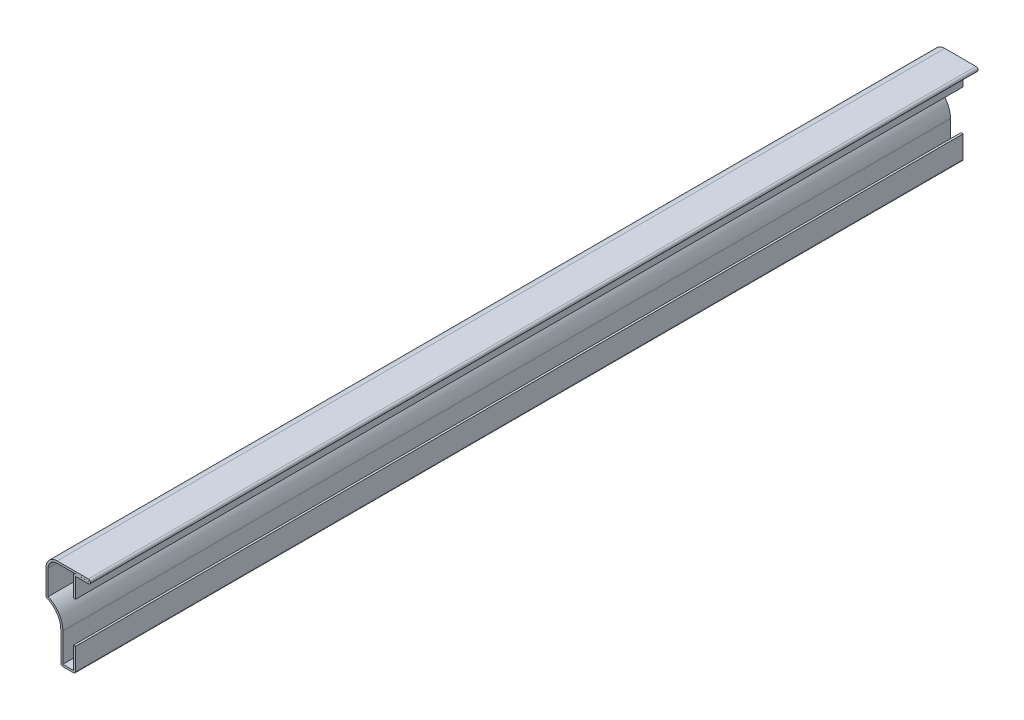
ISO-10303-21;
HEADER;
FILE_DESCRIPTION(('STEP AP214'),'2;1');
FILE_NAME('part.step','',(''),(''),'','','');
FILE_SCHEMA(('AUTOMOTIVE_DESIGN { 1 0 10303 214 1 1 1 1 }'));
ENDSEC;
DATA;
#1=APPLICATION_CONTEXT('core data for automotive mechanical design processes');
#2=APPLICATION_PROTOCOL_DEFINITION('international standard','automotive_design',2000,#1);
#3=PRODUCT_CONTEXT('',#1,'mechanical');
#4=PRODUCT('Part','Part','',(#3));
#5=PRODUCT_RELATED_PRODUCT_CATEGORY('part','',(#4));
#6=PRODUCT_DEFINITION_FORMATION('','',#4);
#7=PRODUCT_DEFINITION_CONTEXT('part definition',#1,'design');
#8=PRODUCT_DEFINITION('design','',#6,#7);
#9=PRODUCT_DEFINITION_SHAPE('','',#8);
#10=(LENGTH_UNIT() NAMED_UNIT(*) SI_UNIT(.MILLI.,.METRE.));
#11=(NAMED_UNIT(*) PLANE_ANGLE_UNIT() SI_UNIT($,.RADIAN.));
#12=(NAMED_UNIT(*) SI_UNIT($,.STERADIAN.) SOLID_ANGLE_UNIT());
#13=UNCERTAINTY_MEASURE_WITH_UNIT(LENGTH_MEASURE(1.E-05),#10,'distance_accuracy_value','');
#14=(GEOMETRIC_REPRESENTATION_CONTEXT(3) GLOBAL_UNCERTAINTY_ASSIGNED_CONTEXT((#13)) GLOBAL_UNIT_ASSIGNED_CONTEXT((#10,
#11,#12)) REPRESENTATION_CONTEXT('',''));
#15=CARTESIAN_POINT('',(0.,0.,0.));
#16=DIRECTION('',(0.,0.,1.));
#17=DIRECTION('',(1.,0.,0.));
#18=AXIS2_PLACEMENT_3D('',#15,#16,#17);
#19=CARTESIAN_POINT('',(0.,0.,-381.));
#20=DIRECTION('',(1.,0.,0.));
#21=DIRECTION('',(0.,0.,-1.));
#22=AXIS2_PLACEMENT_3D('',#19,#20,#21);
#23=PLANE('',#22);
#24=DIRECTION('',(0.,1.,0.));
#25=VECTOR('',#24,1.);
#26=CARTESIAN_POINT('',(0.,0.,0.));
#27=LINE('',#26,#25);
#28=CARTESIAN_POINT('',(0.,0.889,0.));
#29=VERTEX_POINT('',#28);
#30=CARTESIAN_POINT('',(0.,10.31875,0.));
#31=VERTEX_POINT('',#30);
#32=EDGE_CURVE('E352',#29,#31,#27,.T.);
#33=ORIENTED_EDGE('',*,*,#32,.F.);
#34=DIRECTION('',(0.,0.,1.));
#35=VECTOR('',#34,1.);
#36=CARTESIAN_POINT('',(0.,0.889,-381.));
#37=LINE('',#36,#35);
#38=CARTESIAN_POINT('',(0.,0.889,-381.));
#39=VERTEX_POINT('',#38);
#40=EDGE_CURVE('E216',#29,#39,#37,.F.);
#41=ORIENTED_EDGE('',*,*,#40,.T.);
#42=DIRECTION('',(0.,1.,0.));
#43=VECTOR('',#42,1.);
#44=CARTESIAN_POINT('',(0.,0.,-381.));
#45=LINE('',#44,#43);
#46=CARTESIAN_POINT('',(0.,10.31875,-381.));
#47=VERTEX_POINT('',#46);
#48=EDGE_CURVE('E209',#39,#47,#45,.T.);
#49=ORIENTED_EDGE('',*,*,#48,.T.);
#50=DIRECTION('',(0.,0.,1.));
#51=VECTOR('',#50,1.);
#52=CARTESIAN_POINT('',(0.,10.31875,-381.));
#53=LINE('',#52,#51);
#54=EDGE_CURVE('E213',#47,#31,#53,.T.);
#55=ORIENTED_EDGE('',*,*,#54,.T.);
#56=EDGE_LOOP('',(#33,#41,#49,#55));
#57=FACE_BOUND('',#56,.T.);
#58=ADVANCED_FACE('F35',(#57),#23,.T.);
#59=CARTESIAN_POINT('',(-6.35,0.,-381.));
#60=DIRECTION('',(0.,-1.,0.));
#61=DIRECTION('',(0.,0.,-1.));
#62=AXIS2_PLACEMENT_3D('',#59,#60,#61);
#63=PLANE('',#62);
#64=DIRECTION('',(1.,0.,0.));
#65=VECTOR('',#64,1.);
#66=CARTESIAN_POINT('',(-6.35,0.,-381.));
#67=LINE('',#66,#65);
#68=CARTESIAN_POINT('',(-5.461,0.,-381.));
#69=VERTEX_POINT('',#68);
#70=CARTESIAN_POINT('',(-0.889,0.,-381.));
#71=VERTEX_POINT('',#70);
#72=EDGE_CURVE('E233',#69,#71,#67,.T.);
#73=ORIENTED_EDGE('',*,*,#72,.T.);
#74=DIRECTION('',(0.,0.,1.));
#75=VECTOR('',#74,1.);
#76=CARTESIAN_POINT('',(-0.889,0.,-381.));
#77=LINE('',#76,#75);
#78=CARTESIAN_POINT('',(-0.889,0.,0.));
#79=VERTEX_POINT('',#78);
#80=EDGE_CURVE('E244',#71,#79,#77,.T.);
#81=ORIENTED_EDGE('',*,*,#80,.T.);
#82=DIRECTION('',(1.,0.,0.));
#83=VECTOR('',#82,1.);
#84=CARTESIAN_POINT('',(-6.35,0.,0.));
#85=LINE('',#84,#83);
#86=CARTESIAN_POINT('',(-5.461,0.,0.));
#87=VERTEX_POINT('',#86);
#88=EDGE_CURVE('E219',#87,#79,#85,.T.);
#89=ORIENTED_EDGE('',*,*,#88,.F.);
#90=DIRECTION('',(0.,0.,1.));
#91=VECTOR('',#90,1.);
#92=CARTESIAN_POINT('',(-5.461,0.,-381.));
#93=LINE('',#92,#91);
#94=EDGE_CURVE('E242',#87,#69,#93,.F.);
#95=ORIENTED_EDGE('',*,*,#94,.T.);
#96=EDGE_LOOP('',(#73,#81,#89,#95));
#97=FACE_BOUND('',#96,.T.);
#98=ADVANCED_FACE('F407',(#97),#63,.T.);
#99=CARTESIAN_POINT('',(-6.34999999999999,13.2447438789308,-381.));
#100=DIRECTION('',(-1.,0.,0.));
#101=DIRECTION('',(0.,-1.,0.));
#102=AXIS2_PLACEMENT_3D('',#99,#100,#101);
#103=PLANE('',#102);
#104=DIRECTION('',(0.,-1.,0.));
#105=VECTOR('',#104,1.);
#106=CARTESIAN_POINT('',(-6.34999999999999,13.2447438789308,-381.));
#107=LINE('',#106,#105);
#108=CARTESIAN_POINT('',(-6.34999999999999,13.2447438789308,-381.));
#109=VERTEX_POINT('',#108);
#110=CARTESIAN_POINT('',(-6.35,0.889000000000001,-381.));
#111=VERTEX_POINT('',#110);
#112=EDGE_CURVE('E238',#109,#111,#107,.T.);
#113=ORIENTED_EDGE('',*,*,#112,.T.);
#114=DIRECTION('',(0.,0.,1.));
#115=VECTOR('',#114,1.);
#116=CARTESIAN_POINT('',(-6.35,0.889000000000001,-381.));
#117=LINE('',#116,#115);
#118=CARTESIAN_POINT('',(-6.35,0.889000000000001,0.));
#119=VERTEX_POINT('',#118);
#120=EDGE_CURVE('E264',#111,#119,#117,.T.);
#121=ORIENTED_EDGE('',*,*,#120,.T.);
#122=DIRECTION('',(0.,-1.,0.));
#123=VECTOR('',#122,1.);
#124=CARTESIAN_POINT('',(-6.34999999999999,13.2447438789308,0.));
#125=LINE('',#124,#123);
#126=CARTESIAN_POINT('',(-6.34999999999999,13.2447438789308,0.));
#127=VERTEX_POINT('',#126);
#128=EDGE_CURVE('E292',#127,#119,#125,.T.);
#129=ORIENTED_EDGE('',*,*,#128,.F.);
#130=DIRECTION('',(0.,0.,1.));
#131=VECTOR('',#130,1.);
#132=CARTESIAN_POINT('',(-6.34999999999999,13.2447438789308,-381.));
#133=LINE('',#132,#131);
#134=EDGE_CURVE('E245',#109,#127,#133,.T.);
#135=ORIENTED_EDGE('',*,*,#134,.F.);
#136=EDGE_LOOP('',(#113,#121,#129,#135));
#137=FACE_BOUND('',#136,.T.);
#138=ADVANCED_FACE('F416',(#137),#103,.T.);
#139=CARTESIAN_POINT('',(-15.875,13.2447438789308,-381.));
#140=DIRECTION('',(0.,0.,1.));
#141=DIRECTION('',(1.,0.,0.));
#142=AXIS2_PLACEMENT_3D('',#139,#140,#141);
#143=CYLINDRICAL_SURFACE('',#142,9.525);
#144=CARTESIAN_POINT('',(-15.875,13.2447438789308,0.));
#145=DIRECTION('',(0.,0.,-1.));
#146=DIRECTION('',(-1.,0.,0.));
#147=AXIS2_PLACEMENT_3D('',#144,#145,#146);
#148=CIRCLE('',#147,9.525);
#149=CARTESIAN_POINT('',(-12.1579268292683,22.0145210735594,0.));
#150=VERTEX_POINT('',#149);
#151=EDGE_CURVE('E290',#150,#127,#148,.T.);
#152=ORIENTED_EDGE('',*,*,#151,.F.);
#153=DIRECTION('',(0.,0.,1.));
#154=VECTOR('',#153,1.);
#155=CARTESIAN_POINT('',(-12.1579268292683,22.0145210735594,-381.));
#156=LINE('',#155,#154);
#157=CARTESIAN_POINT('',(-12.1579268292683,22.0145210735594,-381.));
#158=VERTEX_POINT('',#157);
#159=EDGE_CURVE('E11',#150,#158,#156,.F.);
#160=ORIENTED_EDGE('',*,*,#159,.T.);
#161=CARTESIAN_POINT('',(-15.875,13.2447438789308,-381.));
#162=DIRECTION('',(0.,0.,-1.));
#163=DIRECTION('',(-1.,0.,0.));
#164=AXIS2_PLACEMENT_3D('',#161,#162,#163);
#165=CIRCLE('',#164,9.525);
#166=EDGE_CURVE('E394',#158,#109,#165,.T.);
#167=ORIENTED_EDGE('',*,*,#166,.T.);
#168=ORIENTED_EDGE('',*,*,#134,.T.);
#169=EDGE_LOOP('',(#152,#160,#167,#168));
#170=FACE_BOUND('',#169,.T.);
#171=ADVANCED_FACE('F419',(#170),#143,.F.);
#172=CARTESIAN_POINT('',(-12.7,33.3375,-381.));
#173=DIRECTION('',(-1.,0.,0.));
#174=DIRECTION('',(0.,-1.,0.));
#175=AXIS2_PLACEMENT_3D('',#172,#173,#174);
#176=PLANE('',#175);
#177=DIRECTION('',(0.,-1.,0.));
#178=VECTOR('',#177,1.);
#179=CARTESIAN_POINT('',(-12.7,33.3375,-381.));
#180=LINE('',#179,#178);
#181=CARTESIAN_POINT('',(-12.7,33.3375,-381.));
#182=VERTEX_POINT('',#181);
#183=CARTESIAN_POINT('',(-12.7,22.8330336117247,-381.));
#184=VERTEX_POINT('',#183);
#185=EDGE_CURVE('E280',#182,#184,#180,.T.);
#186=ORIENTED_EDGE('',*,*,#185,.T.);
#187=DIRECTION('',(0.,0.,1.));
#188=VECTOR('',#187,1.);
#189=CARTESIAN_POINT('',(-12.7,22.8330336117247,-381.));
#190=LINE('',#189,#188);
#191=CARTESIAN_POINT('',(-12.7,22.8330336117247,0.));
#192=VERTEX_POINT('',#191);
#193=EDGE_CURVE('E43',#184,#192,#190,.T.);
#194=ORIENTED_EDGE('',*,*,#193,.T.);
#195=DIRECTION('',(0.,-1.,0.));
#196=VECTOR('',#195,1.);
#197=CARTESIAN_POINT('',(-12.7,33.3375,0.));
#198=LINE('',#197,#196);
#199=CARTESIAN_POINT('',(-12.7,33.3375,0.));
#200=VERTEX_POINT('',#199);
#201=EDGE_CURVE('E277',#200,#192,#198,.T.);
#202=ORIENTED_EDGE('',*,*,#201,.F.);
#203=DIRECTION('',(0.,0.,1.));
#204=VECTOR('',#203,1.);
#205=CARTESIAN_POINT('',(-12.7,33.3375,-381.));
#206=LINE('',#205,#204);
#207=EDGE_CURVE('E303',#182,#200,#206,.T.);
#208=ORIENTED_EDGE('',*,*,#207,.F.);
#209=EDGE_LOOP('',(#186,#194,#202,#208));
#210=FACE_BOUND('',#209,.T.);
#211=ADVANCED_FACE('F276',(#210),#176,.T.);
#212=CARTESIAN_POINT('',(-7.9375,33.3375,-381.));
#213=DIRECTION('',(0.,0.,1.));
#214=DIRECTION('',(1.,0.,0.));
#215=AXIS2_PLACEMENT_3D('',#212,#213,#214);
#216=CYLINDRICAL_SURFACE('',#215,4.7625);
#217=CARTESIAN_POINT('',(-7.9375,33.3375,0.));
#218=DIRECTION('',(0.,0.,1.));
#219=DIRECTION('',(1.,0.,0.));
#220=AXIS2_PLACEMENT_3D('',#217,#218,#219);
#221=CIRCLE('',#220,4.7625);
#222=CARTESIAN_POINT('',(-7.9375,38.1,0.));
#223=VERTEX_POINT('',#222);
#224=EDGE_CURVE('E289',#223,#200,#221,.T.);
#225=ORIENTED_EDGE('',*,*,#224,.F.);
#226=DIRECTION('',(0.,0.,1.));
#227=VECTOR('',#226,1.);
#228=CARTESIAN_POINT('',(-7.9375,38.1,-381.));
#229=LINE('',#228,#227);
#230=CARTESIAN_POINT('',(-7.9375,38.1,-381.));
#231=VERTEX_POINT('',#230);
#232=EDGE_CURVE('E305',#231,#223,#229,.T.);
#233=ORIENTED_EDGE('',*,*,#232,.F.);
#234=CARTESIAN_POINT('',(-7.9375,33.3375,-381.));
#235=DIRECTION('',(0.,0.,1.));
#236=DIRECTION('',(1.,0.,0.));
#237=AXIS2_PLACEMENT_3D('',#234,#235,#236);
#238=CIRCLE('',#237,4.7625);
#239=EDGE_CURVE('E392',#231,#182,#238,.T.);
#240=ORIENTED_EDGE('',*,*,#239,.T.);
#241=ORIENTED_EDGE('',*,*,#207,.T.);
#242=EDGE_LOOP('',(#225,#233,#240,#241));
#243=FACE_BOUND('',#242,.T.);
#244=ADVANCED_FACE('F391',(#243),#216,.T.);
#245=CARTESIAN_POINT('',(5.4483,38.1,-381.));
#246=DIRECTION('',(0.,1.,0.));
#247=DIRECTION('',(0.,0.,1.));
#248=AXIS2_PLACEMENT_3D('',#245,#246,#247);
#249=PLANE('',#248);
#250=DIRECTION('',(-1.,0.,0.));
#251=VECTOR('',#250,1.);
#252=CARTESIAN_POINT('',(5.4483,38.1,0.));
#253=LINE('',#252,#251);
#254=CARTESIAN_POINT('',(5.4483,38.1,0.));
#255=VERTEX_POINT('',#254);
#256=EDGE_CURVE('E294',#255,#223,#253,.T.);
#257=ORIENTED_EDGE('',*,*,#256,.F.);
#258=DIRECTION('',(0.,0.,1.));
#259=VECTOR('',#258,1.);
#260=CARTESIAN_POINT('',(5.4483,38.1,-381.));
#261=LINE('',#260,#259);
#262=CARTESIAN_POINT('',(5.4483,38.1,-381.));
#263=VERTEX_POINT('',#262);
#264=EDGE_CURVE('E307',#263,#255,#261,.T.);
#265=ORIENTED_EDGE('',*,*,#264,.F.);
#266=DIRECTION('',(-1.,0.,0.));
#267=VECTOR('',#266,1.);
#268=CARTESIAN_POINT('',(5.4483,38.1,-381.));
#269=LINE('',#268,#267);
#270=EDGE_CURVE('E387',#263,#231,#269,.T.);
#271=ORIENTED_EDGE('',*,*,#270,.T.);
#272=ORIENTED_EDGE('',*,*,#232,.T.);
#273=EDGE_LOOP('',(#257,#265,#271,#272));
#274=FACE_BOUND('',#273,.T.);
#275=ADVANCED_FACE('F384',(#274),#249,.T.);
#276=CARTESIAN_POINT('',(5.4483,37.1983,-381.));
#277=DIRECTION('',(0.,0.,1.));
#278=DIRECTION('',(1.,0.,0.));
#279=AXIS2_PLACEMENT_3D('',#276,#277,#278);
#280=CYLINDRICAL_SURFACE('',#279,0.901699999999998);
#281=CARTESIAN_POINT('',(5.4483,37.1983,0.));
#282=DIRECTION('',(0.,0.,1.));
#283=DIRECTION('',(1.,0.,0.));
#284=AXIS2_PLACEMENT_3D('',#281,#282,#283);
#285=CIRCLE('',#284,0.901699999999998);
#286=CARTESIAN_POINT('',(5.4483,36.2966,0.));
#287=VERTEX_POINT('',#286);
#288=EDGE_CURVE('E379',#287,#255,#285,.T.);
#289=ORIENTED_EDGE('',*,*,#288,.F.);
#290=DIRECTION('',(0.,0.,1.));
#291=VECTOR('',#290,1.);
#292=CARTESIAN_POINT('',(5.4483,36.2966,-381.));
#293=LINE('',#292,#291);
#294=CARTESIAN_POINT('',(5.4483,36.2966,-381.));
#295=VERTEX_POINT('',#294);
#296=EDGE_CURVE('E309',#295,#287,#293,.T.);
#297=ORIENTED_EDGE('',*,*,#296,.F.);
#298=CARTESIAN_POINT('',(5.4483,37.1983,-381.));
#299=DIRECTION('',(0.,0.,1.));
#300=DIRECTION('',(1.,0.,0.));
#301=AXIS2_PLACEMENT_3D('',#298,#299,#300);
#302=CIRCLE('',#301,0.901699999999998);
#303=EDGE_CURVE('E681',#295,#263,#302,.T.);
#304=ORIENTED_EDGE('',*,*,#303,.T.);
#305=ORIENTED_EDGE('',*,*,#264,.T.);
#306=EDGE_LOOP('',(#289,#297,#304,#305));
#307=FACE_BOUND('',#306,.T.);
#308=ADVANCED_FACE('F593',(#307),#280,.T.);
#309=CARTESIAN_POINT('',(0.,36.2966,-381.));
#310=DIRECTION('',(0.,-1.,0.));
#311=DIRECTION('',(1.,0.,0.));
#312=AXIS2_PLACEMENT_3D('',#309,#310,#311);
#313=PLANE('',#312);
#314=DIRECTION('',(1.,0.,0.));
#315=VECTOR('',#314,1.);
#316=CARTESIAN_POINT('',(0.,36.2966,0.));
#317=LINE('',#316,#315);
#318=CARTESIAN_POINT('',(0.,36.2966,0.));
#319=VERTEX_POINT('',#318);
#320=EDGE_CURVE('E376',#319,#287,#317,.T.);
#321=ORIENTED_EDGE('',*,*,#320,.F.);
#322=DIRECTION('',(0.,0.,1.));
#323=VECTOR('',#322,1.);
#324=CARTESIAN_POINT('',(0.,36.2966,-381.));
#325=LINE('',#324,#323);
#326=CARTESIAN_POINT('',(0.,36.2966,-381.));
#327=VERTEX_POINT('',#326);
#328=EDGE_CURVE('E311',#327,#319,#325,.T.);
#329=ORIENTED_EDGE('',*,*,#328,.F.);
#330=DIRECTION('',(1.,0.,0.));
#331=VECTOR('',#330,1.);
#332=CARTESIAN_POINT('',(0.,36.2966,-381.));
#333=LINE('',#332,#331);
#334=EDGE_CURVE('E678',#327,#295,#333,.T.);
#335=ORIENTED_EDGE('',*,*,#334,.T.);
#336=ORIENTED_EDGE('',*,*,#296,.T.);
#337=EDGE_LOOP('',(#321,#329,#335,#336));
#338=FACE_BOUND('',#337,.T.);
#339=ADVANCED_FACE('F584',(#338),#313,.T.);
#340=CARTESIAN_POINT('',(0.,27.78125,-381.));
#341=DIRECTION('',(1.,0.,0.));
#342=DIRECTION('',(0.,0.,-1.));
#343=AXIS2_PLACEMENT_3D('',#340,#341,#342);
#344=PLANE('',#343);
#345=DIRECTION('',(0.,1.,0.));
#346=VECTOR('',#345,1.);
#347=CARTESIAN_POINT('',(0.,27.78125,0.));
#348=LINE('',#347,#346);
#349=CARTESIAN_POINT('',(0.,27.78125,0.));
#350=VERTEX_POINT('',#349);
#351=EDGE_CURVE('E373',#350,#319,#348,.T.);
#352=ORIENTED_EDGE('',*,*,#351,.F.);
#353=DIRECTION('',(0.,0.,1.));
#354=VECTOR('',#353,1.);
#355=CARTESIAN_POINT('',(0.,27.78125,-381.));
#356=LINE('',#355,#354);
#357=CARTESIAN_POINT('',(0.,27.78125,-381.));
#358=VERTEX_POINT('',#357);
#359=EDGE_CURVE('E313',#358,#350,#356,.T.);
#360=ORIENTED_EDGE('',*,*,#359,.F.);
#361=DIRECTION('',(0.,1.,0.));
#362=VECTOR('',#361,1.);
#363=CARTESIAN_POINT('',(0.,27.78125,-381.));
#364=LINE('',#363,#362);
#365=EDGE_CURVE('E682',#358,#327,#364,.T.);
#366=ORIENTED_EDGE('',*,*,#365,.T.);
#367=ORIENTED_EDGE('',*,*,#328,.T.);
#368=EDGE_LOOP('',(#352,#360,#366,#367));
#369=FACE_BOUND('',#368,.T.);
#370=ADVANCED_FACE('F575',(#369),#344,.T.);
#371=CARTESIAN_POINT('',(0.,27.78125,-381.));
#372=DIRECTION('',(0.,1.,0.));
#373=DIRECTION('',(0.,0.,1.));
#374=AXIS2_PLACEMENT_3D('',#371,#372,#373);
#375=PLANE('',#374);
#376=DIRECTION('',(-1.,0.,0.));
#377=VECTOR('',#376,1.);
#378=CARTESIAN_POINT('',(0.,27.78125,0.));
#379=LINE('',#378,#377);
#380=CARTESIAN_POINT('',(-0.889,27.78125,0.));
#381=VERTEX_POINT('',#380);
#382=EDGE_CURVE('E371',#350,#381,#379,.T.);
#383=ORIENTED_EDGE('',*,*,#382,.T.);
#384=DIRECTION('',(0.,0.,1.));
#385=VECTOR('',#384,1.);
#386=CARTESIAN_POINT('',(-0.889,27.78125,-381.));
#387=LINE('',#386,#385);
#388=CARTESIAN_POINT('',(-0.889,27.78125,-381.));
#389=VERTEX_POINT('',#388);
#390=EDGE_CURVE('E315',#389,#381,#387,.T.);
#391=ORIENTED_EDGE('',*,*,#390,.F.);
#392=DIRECTION('',(-1.,0.,0.));
#393=VECTOR('',#392,1.);
#394=CARTESIAN_POINT('',(0.,27.78125,-381.));
#395=LINE('',#394,#393);
#396=EDGE_CURVE('E685',#358,#389,#395,.T.);
#397=ORIENTED_EDGE('',*,*,#396,.F.);
#398=ORIENTED_EDGE('',*,*,#359,.T.);
#399=EDGE_LOOP('',(#383,#391,#397,#398));
#400=FACE_BOUND('',#399,.T.);
#401=ADVANCED_FACE('F567',(#400),#375,.F.);
#402=CARTESIAN_POINT('',(-0.889,27.78125,-381.));
#403=DIRECTION('',(1.,0.,0.));
#404=DIRECTION('',(0.,0.,-1.));
#405=AXIS2_PLACEMENT_3D('',#402,#403,#404);
#406=PLANE('',#405);
#407=DIRECTION('',(0.,1.,0.));
#408=VECTOR('',#407,1.);
#409=CARTESIAN_POINT('',(-0.889,27.78125,0.));
#410=LINE('',#409,#408);
#411=CARTESIAN_POINT('',(-0.889,36.2966,0.));
#412=VERTEX_POINT('',#411);
#413=EDGE_CURVE('E369',#381,#412,#410,.T.);
#414=ORIENTED_EDGE('',*,*,#413,.T.);
#415=DIRECTION('',(0.,0.,1.));
#416=VECTOR('',#415,1.);
#417=CARTESIAN_POINT('',(-0.889,36.2966,-381.));
#418=LINE('',#417,#416);
#419=CARTESIAN_POINT('',(-0.889,36.2966,-381.));
#420=VERTEX_POINT('',#419);
#421=EDGE_CURVE('E58',#412,#420,#418,.F.);
#422=ORIENTED_EDGE('',*,*,#421,.T.);
#423=DIRECTION('',(0.,1.,0.));
#424=VECTOR('',#423,1.);
#425=CARTESIAN_POINT('',(-0.889,27.78125,-381.));
#426=LINE('',#425,#424);
#427=EDGE_CURVE('E689',#389,#420,#426,.T.);
#428=ORIENTED_EDGE('',*,*,#427,.F.);
#429=ORIENTED_EDGE('',*,*,#390,.T.);
#430=EDGE_LOOP('',(#414,#422,#428,#429));
#431=FACE_BOUND('',#430,.T.);
#432=ADVANCED_FACE('F558',(#431),#406,.F.);
#433=CARTESIAN_POINT('',(0.,37.1856,-381.));
#434=DIRECTION('',(0.,-1.,0.));
#435=DIRECTION('',(1.,0.,0.));
#436=AXIS2_PLACEMENT_3D('',#433,#434,#435);
#437=PLANE('',#436);
#438=DIRECTION('',(1.,0.,0.));
#439=VECTOR('',#438,1.);
#440=CARTESIAN_POINT('',(0.,37.1856,-381.));
#441=LINE('',#440,#439);
#442=CARTESIAN_POINT('',(0.,37.1856,-381.));
#443=VERTEX_POINT('',#442);
#444=CARTESIAN_POINT('',(5.4483,37.1856,-381.));
#445=VERTEX_POINT('',#444);
#446=EDGE_CURVE('E691',#443,#445,#441,.T.);
#447=ORIENTED_EDGE('',*,*,#446,.F.);
#448=DIRECTION('',(0.,0.,1.));
#449=VECTOR('',#448,1.);
#450=CARTESIAN_POINT('',(0.,37.1856,-381.));
#451=LINE('',#450,#449);
#452=CARTESIAN_POINT('',(0.,37.1856,0.));
#453=VERTEX_POINT('',#452);
#454=EDGE_CURVE('E267',#443,#453,#451,.T.);
#455=ORIENTED_EDGE('',*,*,#454,.T.);
#456=DIRECTION('',(1.,0.,0.));
#457=VECTOR('',#456,1.);
#458=CARTESIAN_POINT('',(0.,37.1856,0.));
#459=LINE('',#458,#457);
#460=CARTESIAN_POINT('',(5.4483,37.1856,0.));
#461=VERTEX_POINT('',#460);
#462=EDGE_CURVE('E367',#453,#461,#459,.T.);
#463=ORIENTED_EDGE('',*,*,#462,.T.);
#464=DIRECTION('',(0.,0.,1.));
#465=VECTOR('',#464,1.);
#466=CARTESIAN_POINT('',(5.4483,37.1856,-381.));
#467=LINE('',#466,#465);
#468=EDGE_CURVE('E318',#445,#461,#467,.T.);
#469=ORIENTED_EDGE('',*,*,#468,.F.);
#470=EDGE_LOOP('',(#447,#455,#463,#469));
#471=FACE_BOUND('',#470,.T.);
#472=ADVANCED_FACE('F549',(#471),#437,.F.);
#473=CARTESIAN_POINT('',(5.4483,37.1983,-381.));
#474=DIRECTION('',(0.,0.,1.));
#475=DIRECTION('',(1.,0.,0.));
#476=AXIS2_PLACEMENT_3D('',#473,#474,#475);
#477=CYLINDRICAL_SURFACE('',#476,0.0126999999999983);
#478=CARTESIAN_POINT('',(5.4483,37.1983,0.));
#479=DIRECTION('',(0.,0.,1.));
#480=DIRECTION('',(1.,0.,0.));
#481=AXIS2_PLACEMENT_3D('',#478,#479,#480);
#482=CIRCLE('',#481,0.0126999999999983);
#483=CARTESIAN_POINT('',(5.4483,37.211,0.));
#484=VERTEX_POINT('',#483);
#485=EDGE_CURVE('E365',#461,#484,#482,.T.);
#486=ORIENTED_EDGE('',*,*,#485,.T.);
#487=DIRECTION('',(0.,0.,1.));
#488=VECTOR('',#487,1.);
#489=CARTESIAN_POINT('',(5.4483,37.211,-381.));
#490=LINE('',#489,#488);
#491=CARTESIAN_POINT('',(5.4483,37.211,-381.));
#492=VERTEX_POINT('',#491);
#493=EDGE_CURVE('E321',#492,#484,#490,.T.);
#494=ORIENTED_EDGE('',*,*,#493,.F.);
#495=CARTESIAN_POINT('',(5.4483,37.1983,-381.));
#496=DIRECTION('',(0.,0.,1.));
#497=DIRECTION('',(1.,0.,0.));
#498=AXIS2_PLACEMENT_3D('',#495,#496,#497);
#499=CIRCLE('',#498,0.0126999999999983);
#500=EDGE_CURVE('E693',#445,#492,#499,.T.);
#501=ORIENTED_EDGE('',*,*,#500,.F.);
#502=ORIENTED_EDGE('',*,*,#468,.T.);
#503=EDGE_LOOP('',(#486,#494,#501,#502));
#504=FACE_BOUND('',#503,.T.);
#505=ADVANCED_FACE('F540',(#504),#477,.F.);
#506=CARTESIAN_POINT('',(5.4483,37.211,-381.));
#507=DIRECTION('',(0.,1.,0.));
#508=DIRECTION('',(0.,0.,1.));
#509=AXIS2_PLACEMENT_3D('',#506,#507,#508);
#510=PLANE('',#509);
#511=DIRECTION('',(1.,0.,0.));
#512=VECTOR('',#511,1.);
#513=CARTESIAN_POINT('',(5.4483,37.211,0.));
#514=LINE('',#513,#512);
#515=CARTESIAN_POINT('',(-7.9375,37.211,0.));
#516=VERTEX_POINT('',#515);
#517=EDGE_CURVE('E363',#484,#516,#514,.F.);
#518=ORIENTED_EDGE('',*,*,#517,.T.);
#519=DIRECTION('',(0.,0.,1.));
#520=VECTOR('',#519,1.);
#521=CARTESIAN_POINT('',(-7.9375,37.211,-381.));
#522=LINE('',#521,#520);
#523=CARTESIAN_POINT('',(-7.9375,37.211,-381.));
#524=VERTEX_POINT('',#523);
#525=EDGE_CURVE('E324',#524,#516,#522,.T.);
#526=ORIENTED_EDGE('',*,*,#525,.F.);
#527=DIRECTION('',(1.,0.,0.));
#528=VECTOR('',#527,1.);
#529=CARTESIAN_POINT('',(5.4483,37.211,-381.));
#530=LINE('',#529,#528);
#531=EDGE_CURVE('E695',#492,#524,#530,.F.);
#532=ORIENTED_EDGE('',*,*,#531,.F.);
#533=ORIENTED_EDGE('',*,*,#493,.T.);
#534=EDGE_LOOP('',(#518,#526,#532,#533));
#535=FACE_BOUND('',#534,.T.);
#536=ADVANCED_FACE('F531',(#535),#510,.F.);
#537=CARTESIAN_POINT('',(-7.9375,33.3375,-381.));
#538=DIRECTION('',(0.,0.,1.));
#539=DIRECTION('',(1.,0.,0.));
#540=AXIS2_PLACEMENT_3D('',#537,#538,#539);
#541=CYLINDRICAL_SURFACE('',#540,3.8735);
#542=CARTESIAN_POINT('',(-7.9375,33.3375,0.));
#543=DIRECTION('',(0.,0.,1.));
#544=DIRECTION('',(1.,0.,0.));
#545=AXIS2_PLACEMENT_3D('',#542,#543,#544);
#546=CIRCLE('',#545,3.8735);
#547=CARTESIAN_POINT('',(-11.811,33.3375,0.));
#548=VERTEX_POINT('',#547);
#549=EDGE_CURVE('E361',#516,#548,#546,.T.);
#550=ORIENTED_EDGE('',*,*,#549,.T.);
#551=DIRECTION('',(0.,0.,1.));
#552=VECTOR('',#551,1.);
#553=CARTESIAN_POINT('',(-11.811,33.3375,-381.));
#554=LINE('',#553,#552);
#555=CARTESIAN_POINT('',(-11.811,33.3375,-381.));
#556=VERTEX_POINT('',#555);
#557=EDGE_CURVE('E327',#556,#548,#554,.T.);
#558=ORIENTED_EDGE('',*,*,#557,.F.);
#559=CARTESIAN_POINT('',(-7.9375,33.3375,-381.));
#560=DIRECTION('',(0.,0.,1.));
#561=DIRECTION('',(1.,0.,0.));
#562=AXIS2_PLACEMENT_3D('',#559,#560,#561);
#563=CIRCLE('',#562,3.8735);
#564=EDGE_CURVE('E697',#524,#556,#563,.T.);
#565=ORIENTED_EDGE('',*,*,#564,.F.);
#566=ORIENTED_EDGE('',*,*,#525,.T.);
#567=EDGE_LOOP('',(#550,#558,#565,#566));
#568=FACE_BOUND('',#567,.T.);
#569=ADVANCED_FACE('F522',(#568),#541,.F.);
#570=CARTESIAN_POINT('',(-11.811,33.3375,-381.));
#571=DIRECTION('',(-1.,0.,0.));
#572=DIRECTION('',(0.,-1.,0.));
#573=AXIS2_PLACEMENT_3D('',#570,#571,#572);
#574=PLANE('',#573);
#575=DIRECTION('',(0.,-1.,0.));
#576=VECTOR('',#575,1.);
#577=CARTESIAN_POINT('',(-11.811,33.3375,0.));
#578=LINE('',#577,#576);
#579=CARTESIAN_POINT('',(-11.811,22.8330336117247,0.));
#580=VERTEX_POINT('',#579);
#581=EDGE_CURVE('E359',#548,#580,#578,.T.);
#582=ORIENTED_EDGE('',*,*,#581,.T.);
#583=DIRECTION('',(0.,0.,1.));
#584=VECTOR('',#583,1.);
#585=CARTESIAN_POINT('',(-11.811,22.8330336117247,-381.));
#586=LINE('',#585,#584);
#587=CARTESIAN_POINT('',(-11.811,22.8330336117247,-381.));
#588=VERTEX_POINT('',#587);
#589=EDGE_CURVE('E330',#588,#580,#586,.T.);
#590=ORIENTED_EDGE('',*,*,#589,.F.);
#591=DIRECTION('',(0.,-1.,0.));
#592=VECTOR('',#591,1.);
#593=CARTESIAN_POINT('',(-11.811,33.3375,-381.));
#594=LINE('',#593,#592);
#595=EDGE_CURVE('E699',#556,#588,#594,.T.);
#596=ORIENTED_EDGE('',*,*,#595,.F.);
#597=ORIENTED_EDGE('',*,*,#557,.T.);
#598=EDGE_LOOP('',(#582,#590,#596,#597));
#599=FACE_BOUND('',#598,.T.);
#600=ADVANCED_FACE('F513',(#599),#574,.F.);
#601=CARTESIAN_POINT('',(-15.875,13.2447438789308,-381.));
#602=DIRECTION('',(0.,0.,1.));
#603=DIRECTION('',(1.,0.,0.));
#604=AXIS2_PLACEMENT_3D('',#601,#602,#603);
#605=CYLINDRICAL_SURFACE('',#604,10.414);
#606=CARTESIAN_POINT('',(-15.875,13.2447438789308,0.));
#607=DIRECTION('',(0.,0.,1.));
#608=DIRECTION('',(1.,0.,0.));
#609=AXIS2_PLACEMENT_3D('',#606,#607,#608);
#610=CIRCLE('',#609,10.414);
#611=CARTESIAN_POINT('',(-5.46099999999999,13.2447438789308,0.));
#612=VERTEX_POINT('',#611);
#613=EDGE_CURVE('E357',#580,#612,#610,.F.);
#614=ORIENTED_EDGE('',*,*,#613,.T.);
#615=DIRECTION('',(0.,0.,1.));
#616=VECTOR('',#615,1.);
#617=CARTESIAN_POINT('',(-5.46099999999999,13.2447438789308,-381.));
#618=LINE('',#617,#616);
#619=CARTESIAN_POINT('',(-5.46099999999999,13.2447438789308,-381.));
#620=VERTEX_POINT('',#619);
#621=EDGE_CURVE('E333',#620,#612,#618,.T.);
#622=ORIENTED_EDGE('',*,*,#621,.F.);
#623=CARTESIAN_POINT('',(-15.875,13.2447438789308,-381.));
#624=DIRECTION('',(0.,0.,1.));
#625=DIRECTION('',(1.,0.,0.));
#626=AXIS2_PLACEMENT_3D('',#623,#624,#625);
#627=CIRCLE('',#626,10.414);
#628=EDGE_CURVE('E701',#588,#620,#627,.F.);
#629=ORIENTED_EDGE('',*,*,#628,.F.);
#630=ORIENTED_EDGE('',*,*,#589,.T.);
#631=EDGE_LOOP('',(#614,#622,#629,#630));
#632=FACE_BOUND('',#631,.T.);
#633=ADVANCED_FACE('F504',(#632),#605,.T.);
#634=CARTESIAN_POINT('',(-5.46099999999999,13.2447438789308,-381.));
#635=DIRECTION('',(-1.,0.,0.));
#636=DIRECTION('',(0.,-1.,0.));
#637=AXIS2_PLACEMENT_3D('',#634,#635,#636);
#638=PLANE('',#637);
#639=DIRECTION('',(0.,-1.,0.));
#640=VECTOR('',#639,1.);
#641=CARTESIAN_POINT('',(-5.46099999999999,13.2447438789308,0.));
#642=LINE('',#641,#640);
#643=CARTESIAN_POINT('',(-5.461,0.889,0.));
#644=VERTEX_POINT('',#643);
#645=EDGE_CURVE('E350',#612,#644,#642,.T.);
#646=ORIENTED_EDGE('',*,*,#645,.T.);
#647=DIRECTION('',(0.,0.,1.));
#648=VECTOR('',#647,1.);
#649=CARTESIAN_POINT('',(-5.461,0.889,-381.));
#650=LINE('',#649,#648);
#651=CARTESIAN_POINT('',(-5.461,0.889,-381.));
#652=VERTEX_POINT('',#651);
#653=EDGE_CURVE('E336',#652,#644,#650,.T.);
#654=ORIENTED_EDGE('',*,*,#653,.F.);
#655=DIRECTION('',(0.,-1.,0.));
#656=VECTOR('',#655,1.);
#657=CARTESIAN_POINT('',(-5.46099999999999,13.2447438789308,-381.));
#658=LINE('',#657,#656);
#659=EDGE_CURVE('E703',#620,#652,#658,.T.);
#660=ORIENTED_EDGE('',*,*,#659,.F.);
#661=ORIENTED_EDGE('',*,*,#621,.T.);
#662=EDGE_LOOP('',(#646,#654,#660,#661));
#663=FACE_BOUND('',#662,.T.);
#664=ADVANCED_FACE('F496',(#663),#638,.F.);
#665=CARTESIAN_POINT('',(-6.35,0.889,-381.));
#666=DIRECTION('',(0.,-1.,0.));
#667=DIRECTION('',(0.,0.,-1.));
#668=AXIS2_PLACEMENT_3D('',#665,#666,#667);
#669=PLANE('',#668);
#670=DIRECTION('',(1.,0.,0.));
#671=VECTOR('',#670,1.);
#672=CARTESIAN_POINT('',(-6.35,0.889,0.));
#673=LINE('',#672,#671);
#674=CARTESIAN_POINT('',(-0.889,0.889,0.));
#675=VERTEX_POINT('',#674);
#676=EDGE_CURVE('E348',#644,#675,#673,.T.);
#677=ORIENTED_EDGE('',*,*,#676,.T.);
#678=DIRECTION('',(0.,0.,1.));
#679=VECTOR('',#678,1.);
#680=CARTESIAN_POINT('',(-0.889,0.889,-381.));
#681=LINE('',#680,#679);
#682=CARTESIAN_POINT('',(-0.889,0.889,-381.));
#683=VERTEX_POINT('',#682);
#684=EDGE_CURVE('E235',#683,#675,#681,.T.);
#685=ORIENTED_EDGE('',*,*,#684,.F.);
#686=DIRECTION('',(1.,0.,0.));
#687=VECTOR('',#686,1.);
#688=CARTESIAN_POINT('',(-6.35,0.889,-381.));
#689=LINE('',#688,#687);
#690=EDGE_CURVE('E705',#652,#683,#689,.T.);
#691=ORIENTED_EDGE('',*,*,#690,.F.);
#692=ORIENTED_EDGE('',*,*,#653,.T.);
#693=EDGE_LOOP('',(#677,#685,#691,#692));
#694=FACE_BOUND('',#693,.T.);
#695=ADVANCED_FACE('F489',(#694),#669,.F.);
#696=CARTESIAN_POINT('',(-0.889,0.,-381.));
#697=DIRECTION('',(1.,0.,0.));
#698=DIRECTION('',(0.,0.,-1.));
#699=AXIS2_PLACEMENT_3D('',#696,#697,#698);
#700=PLANE('',#699);
#701=DIRECTION('',(0.,1.,0.));
#702=VECTOR('',#701,1.);
#703=CARTESIAN_POINT('',(-0.889,0.,0.));
#704=LINE('',#703,#702);
#705=CARTESIAN_POINT('',(-0.889,10.31875,0.));
#706=VERTEX_POINT('',#705);
#707=EDGE_CURVE('E343',#675,#706,#704,.T.);
#708=ORIENTED_EDGE('',*,*,#707,.T.);
#709=DIRECTION('',(0.,0.,1.));
#710=VECTOR('',#709,1.);
#711=CARTESIAN_POINT('',(-0.889,10.31875,-381.));
#712=LINE('',#711,#710);
#713=CARTESIAN_POINT('',(-0.889,10.31875,-381.));
#714=VERTEX_POINT('',#713);
#715=EDGE_CURVE('E232',#714,#706,#712,.T.);
#716=ORIENTED_EDGE('',*,*,#715,.F.);
#717=DIRECTION('',(0.,1.,0.));
#718=VECTOR('',#717,1.);
#719=CARTESIAN_POINT('',(-0.889,0.,-381.));
#720=LINE('',#719,#718);
#721=EDGE_CURVE('E224',#683,#714,#720,.T.);
#722=ORIENTED_EDGE('',*,*,#721,.F.);
#723=ORIENTED_EDGE('',*,*,#684,.T.);
#724=EDGE_LOOP('',(#708,#716,#722,#723));
#725=FACE_BOUND('',#724,.T.);
#726=ADVANCED_FACE('F342',(#725),#700,.F.);
#727=CARTESIAN_POINT('',(-0.889,10.31875,-381.));
#728=DIRECTION('',(0.,-1.,0.));
#729=DIRECTION('',(0.,0.,-1.));
#730=AXIS2_PLACEMENT_3D('',#727,#728,#729);
#731=PLANE('',#730);
#732=DIRECTION('',(1.,0.,0.));
#733=VECTOR('',#732,1.);
#734=CARTESIAN_POINT('',(-0.889,10.31875,0.));
#735=LINE('',#734,#733);
#736=EDGE_CURVE('E231',#706,#31,#735,.T.);
#737=ORIENTED_EDGE('',*,*,#736,.T.);
#738=ORIENTED_EDGE('',*,*,#54,.F.);
#739=DIRECTION('',(1.,0.,0.));
#740=VECTOR('',#739,1.);
#741=CARTESIAN_POINT('',(-0.889,10.31875,-381.));
#742=LINE('',#741,#740);
#743=EDGE_CURVE('E218',#714,#47,#742,.T.);
#744=ORIENTED_EDGE('',*,*,#743,.F.);
#745=ORIENTED_EDGE('',*,*,#715,.T.);
#746=EDGE_LOOP('',(#737,#738,#744,#745));
#747=FACE_BOUND('',#746,.T.);
#748=ADVANCED_FACE('F229',(#747),#731,.F.);
#749=CARTESIAN_POINT('',(-15.875,13.2447438789308,-381.));
#750=DIRECTION('',(0.,0.,1.));
#751=DIRECTION('',(1.,0.,0.));
#752=AXIS2_PLACEMENT_3D('',#749,#750,#751);
#753=PLANE('',#752);
#754=ORIENTED_EDGE('',*,*,#48,.F.);
#755=CARTESIAN_POINT('',(-0.889,0.889,-381.));
#756=DIRECTION('',(0.,0.,1.));
#757=DIRECTION('',(1.,0.,0.));
#758=AXIS2_PLACEMENT_3D('',#755,#756,#757);
#759=CIRCLE('',#758,0.889);
#760=EDGE_CURVE('E262',#39,#71,#759,.F.);
#761=ORIENTED_EDGE('',*,*,#760,.T.);
#762=ORIENTED_EDGE('',*,*,#72,.F.);
#763=CARTESIAN_POINT('',(-5.461,0.889000000000001,-381.));
#764=DIRECTION('',(0.,0.,1.));
#765=DIRECTION('',(1.,0.,0.));
#766=AXIS2_PLACEMENT_3D('',#763,#764,#765);
#767=CIRCLE('',#766,0.889);
#768=EDGE_CURVE('E260',#69,#111,#767,.F.);
#769=ORIENTED_EDGE('',*,*,#768,.T.);
#770=ORIENTED_EDGE('',*,*,#112,.F.);
#771=ORIENTED_EDGE('',*,*,#166,.F.);
#772=CARTESIAN_POINT('',(-11.811,22.8330336117247,-381.));
#773=DIRECTION('',(0.,0.,1.));
#774=DIRECTION('',(1.,0.,0.));
#775=AXIS2_PLACEMENT_3D('',#772,#773,#774);
#776=CIRCLE('',#775,0.889);
#777=EDGE_CURVE('E257',#158,#184,#776,.F.);
#778=ORIENTED_EDGE('',*,*,#777,.T.);
#779=ORIENTED_EDGE('',*,*,#185,.F.);
#780=ORIENTED_EDGE('',*,*,#239,.F.);
#781=ORIENTED_EDGE('',*,*,#270,.F.);
#782=ORIENTED_EDGE('',*,*,#303,.F.);
#783=ORIENTED_EDGE('',*,*,#334,.F.);
#784=ORIENTED_EDGE('',*,*,#365,.F.);
#785=ORIENTED_EDGE('',*,*,#396,.T.);
#786=ORIENTED_EDGE('',*,*,#427,.T.);
#787=CARTESIAN_POINT('',(0.,36.2966,-381.));
#788=DIRECTION('',(0.,0.,1.));
#789=DIRECTION('',(1.,0.,0.));
#790=AXIS2_PLACEMENT_3D('',#787,#788,#789);
#791=CIRCLE('',#790,0.889);
#792=EDGE_CURVE('E50',#420,#443,#791,.F.);
#793=ORIENTED_EDGE('',*,*,#792,.T.);
#794=ORIENTED_EDGE('',*,*,#446,.T.);
#795=ORIENTED_EDGE('',*,*,#500,.T.);
#796=ORIENTED_EDGE('',*,*,#531,.T.);
#797=ORIENTED_EDGE('',*,*,#564,.T.);
#798=ORIENTED_EDGE('',*,*,#595,.T.);
#799=ORIENTED_EDGE('',*,*,#628,.T.);
#800=ORIENTED_EDGE('',*,*,#659,.T.);
#801=ORIENTED_EDGE('',*,*,#690,.T.);
#802=ORIENTED_EDGE('',*,*,#721,.T.);
#803=ORIENTED_EDGE('',*,*,#743,.T.);
#804=EDGE_LOOP('',(#754,#761,#762,#769,#770,#771,#778,#779,#780,#781,#782,#783,#784,#785,#786,
#793,#794,#795,#796,#797,#798,#799,#800,#801,#802,#803));
#805=FACE_BOUND('',#804,.T.);
#806=ADVANCED_FACE('F222',(#805),#753,.F.);
#807=CARTESIAN_POINT('',(-15.875,13.2447438789308,0.));
#808=DIRECTION('',(0.,0.,1.));
#809=DIRECTION('',(1.,0.,0.));
#810=AXIS2_PLACEMENT_3D('',#807,#808,#809);
#811=PLANE('',#810);
#812=ORIENTED_EDGE('',*,*,#88,.T.);
#813=CARTESIAN_POINT('',(-0.889,0.889,0.));
#814=DIRECTION('',(0.,0.,1.));
#815=DIRECTION('',(1.,0.,0.));
#816=AXIS2_PLACEMENT_3D('',#813,#814,#815);
#817=CIRCLE('',#816,0.889);
#818=EDGE_CURVE('E254',#79,#29,#817,.T.);
#819=ORIENTED_EDGE('',*,*,#818,.T.);
#820=ORIENTED_EDGE('',*,*,#32,.T.);
#821=ORIENTED_EDGE('',*,*,#736,.F.);
#822=ORIENTED_EDGE('',*,*,#707,.F.);
#823=ORIENTED_EDGE('',*,*,#676,.F.);
#824=ORIENTED_EDGE('',*,*,#645,.F.);
#825=ORIENTED_EDGE('',*,*,#613,.F.);
#826=ORIENTED_EDGE('',*,*,#581,.F.);
#827=ORIENTED_EDGE('',*,*,#549,.F.);
#828=ORIENTED_EDGE('',*,*,#517,.F.);
#829=ORIENTED_EDGE('',*,*,#485,.F.);
#830=ORIENTED_EDGE('',*,*,#462,.F.);
#831=CARTESIAN_POINT('',(0.,36.2966,0.));
#832=DIRECTION('',(0.,0.,1.));
#833=DIRECTION('',(1.,0.,0.));
#834=AXIS2_PLACEMENT_3D('',#831,#832,#833);
#835=CIRCLE('',#834,0.889);
#836=EDGE_CURVE('E250',#453,#412,#835,.T.);
#837=ORIENTED_EDGE('',*,*,#836,.T.);
#838=ORIENTED_EDGE('',*,*,#413,.F.);
#839=ORIENTED_EDGE('',*,*,#382,.F.);
#840=ORIENTED_EDGE('',*,*,#351,.T.);
#841=ORIENTED_EDGE('',*,*,#320,.T.);
#842=ORIENTED_EDGE('',*,*,#288,.T.);
#843=ORIENTED_EDGE('',*,*,#256,.T.);
#844=ORIENTED_EDGE('',*,*,#224,.T.);
#845=ORIENTED_EDGE('',*,*,#201,.T.);
#846=CARTESIAN_POINT('',(-11.811,22.8330336117247,0.));
#847=DIRECTION('',(0.,0.,1.));
#848=DIRECTION('',(1.,0.,0.));
#849=AXIS2_PLACEMENT_3D('',#846,#847,#848);
#850=CIRCLE('',#849,0.889);
#851=EDGE_CURVE('E248',#192,#150,#850,.T.);
#852=ORIENTED_EDGE('',*,*,#851,.T.);
#853=ORIENTED_EDGE('',*,*,#151,.T.);
#854=ORIENTED_EDGE('',*,*,#128,.T.);
#855=CARTESIAN_POINT('',(-5.461,0.889000000000001,0.));
#856=DIRECTION('',(0.,0.,1.));
#857=DIRECTION('',(1.,0.,0.));
#858=AXIS2_PLACEMENT_3D('',#855,#856,#857);
#859=CIRCLE('',#858,0.889);
#860=EDGE_CURVE('E252',#119,#87,#859,.T.);
#861=ORIENTED_EDGE('',*,*,#860,.T.);
#862=EDGE_LOOP('',(#812,#819,#820,#821,#822,#823,#824,#825,#826,#827,#828,#829,#830,#837,#838,
#839,#840,#841,#842,#843,#844,#845,#852,#853,#854,#861));
#863=FACE_BOUND('',#862,.T.);
#864=ADVANCED_FACE('F285',(#863),#811,.T.);
#865=CARTESIAN_POINT('',(-0.889,0.889,-381.));
#866=DIRECTION('',(0.,0.,1.));
#867=DIRECTION('',(1.,0.,0.));
#868=AXIS2_PLACEMENT_3D('',#865,#866,#867);
#869=CYLINDRICAL_SURFACE('',#868,0.889);
#870=ORIENTED_EDGE('',*,*,#760,.F.);
#871=ORIENTED_EDGE('',*,*,#40,.F.);
#872=ORIENTED_EDGE('',*,*,#818,.F.);
#873=ORIENTED_EDGE('',*,*,#80,.F.);
#874=EDGE_LOOP('',(#870,#871,#872,#873));
#875=FACE_BOUND('',#874,.T.);
#876=ADVANCED_FACE('F402',(#875),#869,.T.);
#877=CARTESIAN_POINT('',(-5.461,0.889000000000001,-381.));
#878=DIRECTION('',(0.,0.,1.));
#879=DIRECTION('',(1.,0.,0.));
#880=AXIS2_PLACEMENT_3D('',#877,#878,#879);
#881=CYLINDRICAL_SURFACE('',#880,0.889);
#882=ORIENTED_EDGE('',*,*,#768,.F.);
#883=ORIENTED_EDGE('',*,*,#94,.F.);
#884=ORIENTED_EDGE('',*,*,#860,.F.);
#885=ORIENTED_EDGE('',*,*,#120,.F.);
#886=EDGE_LOOP('',(#882,#883,#884,#885));
#887=FACE_BOUND('',#886,.T.);
#888=ADVANCED_FACE('F411',(#887),#881,.T.);
#889=CARTESIAN_POINT('',(0.,36.2966,-381.));
#890=DIRECTION('',(0.,0.,1.));
#891=DIRECTION('',(1.,0.,0.));
#892=AXIS2_PLACEMENT_3D('',#889,#890,#891);
#893=CYLINDRICAL_SURFACE('',#892,0.889);
#894=ORIENTED_EDGE('',*,*,#792,.F.);
#895=ORIENTED_EDGE('',*,*,#421,.F.);
#896=ORIENTED_EDGE('',*,*,#836,.F.);
#897=ORIENTED_EDGE('',*,*,#454,.F.);
#898=EDGE_LOOP('',(#894,#895,#896,#897));
#899=FACE_BOUND('',#898,.T.);
#900=ADVANCED_FACE('F422',(#899),#893,.T.);
#901=CARTESIAN_POINT('',(-11.811,22.8330336117247,-381.));
#902=DIRECTION('',(0.,0.,1.));
#903=DIRECTION('',(1.,0.,0.));
#904=AXIS2_PLACEMENT_3D('',#901,#902,#903);
#905=CYLINDRICAL_SURFACE('',#904,0.889);
#906=ORIENTED_EDGE('',*,*,#777,.F.);
#907=ORIENTED_EDGE('',*,*,#159,.F.);
#908=ORIENTED_EDGE('',*,*,#851,.F.);
#909=ORIENTED_EDGE('',*,*,#193,.F.);
#910=EDGE_LOOP('',(#906,#907,#908,#909));
#911=FACE_BOUND('',#910,.T.);
#912=ADVANCED_FACE('F37',(#911),#905,.T.);
#913=CLOSED_SHELL('',(#58,#98,#138,#171,#211,#244,#275,#308,#339,#370,#401,#432,#472,#505,#536,
#569,#600,#633,#664,#695,#726,#748,#806,#864,#876,#888,#900,#912));
#914=MANIFOLD_SOLID_BREP('B2',#913);
#915=ADVANCED_BREP_SHAPE_REPRESENTATION('',(#18,#914),#14);
#916=SHAPE_DEFINITION_REPRESENTATION(#9,#915);
ENDSEC;
END-ISO-10303-21;
